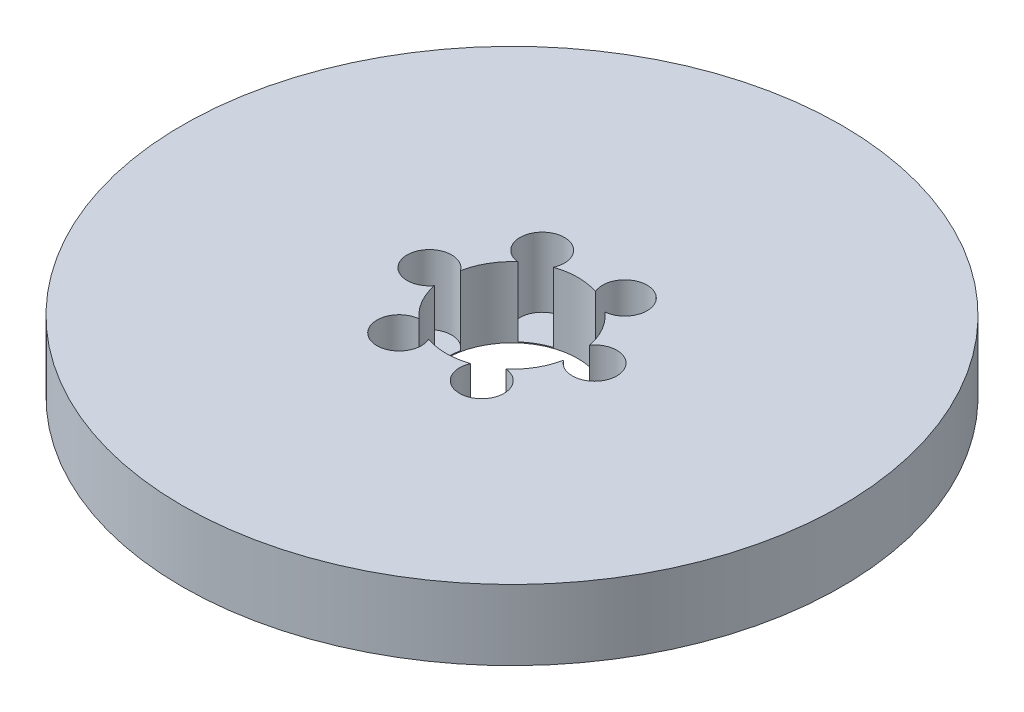
ISO-10303-21;
HEADER;
FILE_DESCRIPTION(('STEP AP214'),'2;1');
FILE_NAME('part.step','',(''),(''),'','','');
FILE_SCHEMA(('AUTOMOTIVE_DESIGN { 1 0 10303 214 1 1 1 1 }'));
ENDSEC;
DATA;
#1=APPLICATION_CONTEXT('core data for automotive mechanical design processes');
#2=APPLICATION_PROTOCOL_DEFINITION('international standard','automotive_design',2000,#1);
#3=PRODUCT_CONTEXT('',#1,'mechanical');
#4=PRODUCT('Part','Part','',(#3));
#5=PRODUCT_RELATED_PRODUCT_CATEGORY('part','',(#4));
#6=PRODUCT_DEFINITION_FORMATION('','',#4);
#7=PRODUCT_DEFINITION_CONTEXT('part definition',#1,'design');
#8=PRODUCT_DEFINITION('design','',#6,#7);
#9=PRODUCT_DEFINITION_SHAPE('','',#8);
#10=(LENGTH_UNIT() NAMED_UNIT(*) SI_UNIT(.MILLI.,.METRE.));
#11=(NAMED_UNIT(*) PLANE_ANGLE_UNIT() SI_UNIT($,.RADIAN.));
#12=(NAMED_UNIT(*) SI_UNIT($,.STERADIAN.) SOLID_ANGLE_UNIT());
#13=UNCERTAINTY_MEASURE_WITH_UNIT(LENGTH_MEASURE(1.E-05),#10,'distance_accuracy_value','');
#14=(GEOMETRIC_REPRESENTATION_CONTEXT(3) GLOBAL_UNCERTAINTY_ASSIGNED_CONTEXT((#13)) GLOBAL_UNIT_ASSIGNED_CONTEXT((#10,
#11,#12)) REPRESENTATION_CONTEXT('',''));
#15=CARTESIAN_POINT('',(0.,0.,0.));
#16=DIRECTION('',(0.,0.,1.));
#17=DIRECTION('',(1.,0.,0.));
#18=AXIS2_PLACEMENT_3D('',#15,#16,#17);
#19=CARTESIAN_POINT('',(0.,8.,0.));
#20=DIRECTION('',(0.,-1.,0.));
#21=DIRECTION('',(0.,0.,-1.));
#22=AXIS2_PLACEMENT_3D('',#19,#20,#21);
#23=CYLINDRICAL_SURFACE('',#22,37.5);
#24=CARTESIAN_POINT('',(0.,8.,0.));
#25=DIRECTION('',(0.,1.,0.));
#26=DIRECTION('',(0.,0.,1.));
#27=AXIS2_PLACEMENT_3D('',#24,#25,#26);
#28=CIRCLE('',#27,37.5);
#29=CARTESIAN_POINT('',(0.,8.,37.5));
#30=VERTEX_POINT('',#29);
#31=EDGE_CURVE('E171',#30,#30,#28,.T.);
#32=ORIENTED_EDGE('',*,*,#31,.F.);
#33=EDGE_LOOP('',(#32));
#34=FACE_BOUND('',#33,.T.);
#35=CARTESIAN_POINT('',(0.,0.,0.));
#36=DIRECTION('',(0.,1.,0.));
#37=DIRECTION('',(0.,0.,1.));
#38=AXIS2_PLACEMENT_3D('',#35,#36,#37);
#39=CIRCLE('',#38,37.5);
#40=CARTESIAN_POINT('',(0.,0.,37.5));
#41=VERTEX_POINT('',#40);
#42=EDGE_CURVE('E157',#41,#41,#39,.T.);
#43=ORIENTED_EDGE('',*,*,#42,.T.);
#44=EDGE_LOOP('',(#43));
#45=FACE_BOUND('',#44,.T.);
#46=ADVANCED_FACE('F39',(#34,#45),#23,.T.);
#47=CARTESIAN_POINT('',(0.,8.,0.));
#48=DIRECTION('',(0.,1.,0.));
#49=DIRECTION('',(0.,0.,1.));
#50=AXIS2_PLACEMENT_3D('',#47,#48,#49);
#51=PLANE('',#50);
#52=CARTESIAN_POINT('',(-4.6996662001571,8.,-8.14006063728605));
#53=DIRECTION('',(0.,1.,0.));
#54=DIRECTION('',(-0.866025403784433,0.,0.50000000000001));
#55=AXIS2_PLACEMENT_3D('',#52,#53,#54);
#56=CIRCLE('',#55,2.53231917771672);
#57=CARTESIAN_POINT('',(-2.38618431158145,8.,-7.11028300640436));
#58=VERTEX_POINT('',#57);
#59=CARTESIAN_POINT('',(-4.96459355585237,8.,-5.62163773514348));
#60=VERTEX_POINT('',#59);
#61=EDGE_CURVE('E214',#58,#60,#56,.T.);
#62=ORIENTED_EDGE('',*,*,#61,.F.);
#63=CARTESIAN_POINT('',(0.,8.,0.));
#64=DIRECTION('',(0.,1.,0.));
#65=DIRECTION('',(0.,0.,1.));
#66=AXIS2_PLACEMENT_3D('',#63,#64,#65);
#67=CIRCLE('',#66,7.5);
#68=CARTESIAN_POINT('',(2.3861843115813,8.,-7.1102830064044));
#69=VERTEX_POINT('',#68);
#70=EDGE_CURVE('E272',#69,#58,#67,.T.);
#71=ORIENTED_EDGE('',*,*,#70,.F.);
#72=CARTESIAN_POINT('',(4.69966620015693,8.,-8.14006063728615));
#73=DIRECTION('',(0.,1.,0.));
#74=DIRECTION('',(-0.866025403784443,0.,-0.499999999999992));
#75=AXIS2_PLACEMENT_3D('',#72,#73,#74);
#76=CIRCLE('',#75,2.53231917771672);
#77=CARTESIAN_POINT('',(4.96459355585225,8.,-5.62163773514358));
#78=VERTEX_POINT('',#77);
#79=EDGE_CURVE('E285',#78,#69,#76,.T.);
#80=ORIENTED_EDGE('',*,*,#79,.F.);
#81=CARTESIAN_POINT('',(7.35077786743367,8.,-1.48864527126085));
#82=VERTEX_POINT('',#81);
#83=EDGE_CURVE('E165',#82,#78,#67,.T.);
#84=ORIENTED_EDGE('',*,*,#83,.F.);
#85=CARTESIAN_POINT('',(9.39933240031402,8.,0.));
#86=DIRECTION('',(0.,1.,0.));
#87=DIRECTION('',(0.,0.,-1.));
#88=AXIS2_PLACEMENT_3D('',#85,#86,#87);
#89=CIRCLE('',#88,2.53231917771672);
#90=CARTESIAN_POINT('',(7.35077786743367,8.,1.48864527126085));
#91=VERTEX_POINT('',#90);
#92=EDGE_CURVE('E281',#91,#82,#89,.T.);
#93=ORIENTED_EDGE('',*,*,#92,.F.);
#94=CARTESIAN_POINT('',(4.96459355585233,8.,5.62163773514352));
#95=VERTEX_POINT('',#94);
#96=EDGE_CURVE('E160',#95,#91,#67,.T.);
#97=ORIENTED_EDGE('',*,*,#96,.F.);
#98=CARTESIAN_POINT('',(4.69966620015705,8.,8.14006063728609));
#99=DIRECTION('',(0.,1.,0.));
#100=DIRECTION('',(0.866025403784436,0.,-0.500000000000004));
#101=AXIS2_PLACEMENT_3D('',#98,#99,#100);
#102=CIRCLE('',#101,2.53231917771672);
#103=CARTESIAN_POINT('',(2.3861843115814,8.,7.11028300640437));
#104=VERTEX_POINT('',#103);
#105=EDGE_CURVE('E154',#104,#95,#102,.T.);
#106=ORIENTED_EDGE('',*,*,#105,.F.);
#107=CARTESIAN_POINT('',(-2.38618431158135,8.,7.11028300640439));
#108=VERTEX_POINT('',#107);
#109=EDGE_CURVE('E150',#108,#104,#67,.T.);
#110=ORIENTED_EDGE('',*,*,#109,.F.);
#111=CARTESIAN_POINT('',(-4.69966620015699,8.,8.14006063728612));
#112=DIRECTION('',(0.,1.,0.));
#113=DIRECTION('',(0.86602540378444,0.,0.499999999999998));
#114=AXIS2_PLACEMENT_3D('',#111,#112,#113);
#115=CIRCLE('',#114,2.53231917771672);
#116=CARTESIAN_POINT('',(-4.96459355585229,8.,5.62163773514355));
#117=VERTEX_POINT('',#116);
#118=EDGE_CURVE('E127',#117,#108,#115,.T.);
#119=ORIENTED_EDGE('',*,*,#118,.F.);
#120=CARTESIAN_POINT('',(-7.35077786743367,8.,1.48864527126085));
#121=VERTEX_POINT('',#120);
#122=EDGE_CURVE('E156',#121,#117,#67,.T.);
#123=ORIENTED_EDGE('',*,*,#122,.F.);
#124=CARTESIAN_POINT('',(-9.39933240031402,8.,0.));
#125=DIRECTION('',(0.,1.,0.));
#126=DIRECTION('',(0.,0.,1.));
#127=AXIS2_PLACEMENT_3D('',#124,#125,#126);
#128=CIRCLE('',#127,2.53231917771672);
#129=CARTESIAN_POINT('',(-7.35077786743367,8.,-1.48864527126085));
#130=VERTEX_POINT('',#129);
#131=EDGE_CURVE('E164',#130,#121,#128,.T.);
#132=ORIENTED_EDGE('',*,*,#131,.F.);
#133=EDGE_CURVE('E159',#60,#130,#67,.T.);
#134=ORIENTED_EDGE('',*,*,#133,.F.);
#135=EDGE_LOOP('',(#62,#71,#80,#84,#93,#97,#106,#110,#119,#123,#132,#134));
#136=FACE_BOUND('',#135,.T.);
#137=ORIENTED_EDGE('',*,*,#31,.T.);
#138=EDGE_LOOP('',(#137));
#139=FACE_BOUND('',#138,.T.);
#140=ADVANCED_FACE('F155',(#136,#139),#51,.T.);
#141=CARTESIAN_POINT('',(0.,0.,0.));
#142=DIRECTION('',(0.,1.,0.));
#143=DIRECTION('',(0.,0.,1.));
#144=AXIS2_PLACEMENT_3D('',#141,#142,#143);
#145=PLANE('',#144);
#146=CARTESIAN_POINT('',(0.,0.,0.));
#147=DIRECTION('',(0.,1.,0.));
#148=DIRECTION('',(0.,0.,1.));
#149=AXIS2_PLACEMENT_3D('',#146,#147,#148);
#150=CIRCLE('',#149,7.5);
#151=CARTESIAN_POINT('',(0.,0.,7.5));
#152=VERTEX_POINT('',#151);
#153=EDGE_CURVE('E170',#152,#152,#150,.T.);
#154=ORIENTED_EDGE('',*,*,#153,.T.);
#155=EDGE_LOOP('',(#154));
#156=FACE_BOUND('',#155,.T.);
#157=ORIENTED_EDGE('',*,*,#42,.F.);
#158=EDGE_LOOP('',(#157));
#159=FACE_BOUND('',#158,.T.);
#160=ADVANCED_FACE('F232',(#156,#159),#145,.F.);
#161=CARTESIAN_POINT('',(0.,8.,0.));
#162=DIRECTION('',(0.,-1.,0.));
#163=DIRECTION('',(0.,0.,-1.));
#164=AXIS2_PLACEMENT_3D('',#161,#162,#163);
#165=CYLINDRICAL_SURFACE('',#164,7.5);
#166=DIRECTION('',(0.,1.,0.));
#167=VECTOR('',#166,1.);
#168=CARTESIAN_POINT('',(-2.38618431158145,4.05151097836171,-7.11028300640436));
#169=LINE('',#168,#167);
#170=CARTESIAN_POINT('',(-2.38618431158145,0.103021956723428,-7.11028300640436));
#171=VERTEX_POINT('',#170);
#172=EDGE_CURVE('E11',#171,#58,#169,.T.);
#173=ORIENTED_EDGE('',*,*,#172,.F.);
#174=CARTESIAN_POINT('',(0.,0.103021956723428,0.));
#175=DIRECTION('',(0.,1.,0.));
#176=DIRECTION('',(0.,0.,1.));
#177=AXIS2_PLACEMENT_3D('',#174,#175,#176);
#178=CIRCLE('',#177,7.5);
#179=CARTESIAN_POINT('',(-4.96459355585237,0.103021956723428,-5.62163773514348));
#180=VERTEX_POINT('',#179);
#181=EDGE_CURVE('E209',#171,#180,#178,.T.);
#182=ORIENTED_EDGE('',*,*,#181,.T.);
#183=DIRECTION('',(0.,1.,0.));
#184=VECTOR('',#183,1.);
#185=CARTESIAN_POINT('',(-4.96459355585237,4.05151097836171,-5.62163773514348));
#186=LINE('',#185,#184);
#187=EDGE_CURVE('E46',#60,#180,#186,.F.);
#188=ORIENTED_EDGE('',*,*,#187,.F.);
#189=ORIENTED_EDGE('',*,*,#133,.T.);
#190=DIRECTION('',(0.,1.,0.));
#191=VECTOR('',#190,1.);
#192=CARTESIAN_POINT('',(-7.35077786743367,4.05151097836171,-1.48864527126085));
#193=LINE('',#192,#191);
#194=CARTESIAN_POINT('',(-7.35077786743367,0.103021956723428,-1.48864527126085));
#195=VERTEX_POINT('',#194);
#196=EDGE_CURVE('E185',#195,#130,#193,.T.);
#197=ORIENTED_EDGE('',*,*,#196,.F.);
#198=CARTESIAN_POINT('',(0.,0.103021956723428,0.));
#199=DIRECTION('',(0.,1.,0.));
#200=DIRECTION('',(0.,0.,1.));
#201=AXIS2_PLACEMENT_3D('',#198,#199,#200);
#202=CIRCLE('',#201,7.5);
#203=CARTESIAN_POINT('',(-7.35077786743367,0.103021956723428,1.48864527126085));
#204=VERTEX_POINT('',#203);
#205=EDGE_CURVE('E173',#195,#204,#202,.T.);
#206=ORIENTED_EDGE('',*,*,#205,.T.);
#207=DIRECTION('',(0.,1.,0.));
#208=VECTOR('',#207,1.);
#209=CARTESIAN_POINT('',(-7.35077786743367,4.05151097836171,1.48864527126085));
#210=LINE('',#209,#208);
#211=EDGE_CURVE('E178',#121,#204,#210,.F.);
#212=ORIENTED_EDGE('',*,*,#211,.F.);
#213=ORIENTED_EDGE('',*,*,#122,.T.);
#214=DIRECTION('',(0.,1.,0.));
#215=VECTOR('',#214,1.);
#216=CARTESIAN_POINT('',(-4.96459355585229,4.05151097836171,5.62163773514355));
#217=LINE('',#216,#215);
#218=CARTESIAN_POINT('',(-4.96459355585229,0.103021956723428,5.62163773514355));
#219=VERTEX_POINT('',#218);
#220=EDGE_CURVE('E132',#219,#117,#217,.T.);
#221=ORIENTED_EDGE('',*,*,#220,.F.);
#222=CARTESIAN_POINT('',(0.,0.103021956723428,0.));
#223=DIRECTION('',(0.,1.,0.));
#224=DIRECTION('',(0.,0.,1.));
#225=AXIS2_PLACEMENT_3D('',#222,#223,#224);
#226=CIRCLE('',#225,7.5);
#227=CARTESIAN_POINT('',(-2.38618431158135,0.103021956723428,7.11028300640439));
#228=VERTEX_POINT('',#227);
#229=EDGE_CURVE('E146',#219,#228,#226,.T.);
#230=ORIENTED_EDGE('',*,*,#229,.T.);
#231=DIRECTION('',(0.,1.,0.));
#232=VECTOR('',#231,1.);
#233=CARTESIAN_POINT('',(-2.38618431158135,4.05151097836171,7.11028300640439));
#234=LINE('',#233,#232);
#235=EDGE_CURVE('E128',#108,#228,#234,.F.);
#236=ORIENTED_EDGE('',*,*,#235,.F.);
#237=ORIENTED_EDGE('',*,*,#109,.T.);
#238=DIRECTION('',(0.,1.,0.));
#239=VECTOR('',#238,1.);
#240=CARTESIAN_POINT('',(2.3861843115814,4.05151097836171,7.11028300640437));
#241=LINE('',#240,#239);
#242=CARTESIAN_POINT('',(2.3861843115814,0.103021956723428,7.11028300640437));
#243=VERTEX_POINT('',#242);
#244=EDGE_CURVE('E192',#243,#104,#241,.T.);
#245=ORIENTED_EDGE('',*,*,#244,.F.);
#246=CARTESIAN_POINT('',(0.,0.103021956723428,0.));
#247=DIRECTION('',(0.,1.,0.));
#248=DIRECTION('',(0.,0.,1.));
#249=AXIS2_PLACEMENT_3D('',#246,#247,#248);
#250=CIRCLE('',#249,7.5);
#251=CARTESIAN_POINT('',(4.96459355585233,0.103021956723428,5.62163773514352));
#252=VERTEX_POINT('',#251);
#253=EDGE_CURVE('E190',#243,#252,#250,.T.);
#254=ORIENTED_EDGE('',*,*,#253,.T.);
#255=DIRECTION('',(0.,1.,0.));
#256=VECTOR('',#255,1.);
#257=CARTESIAN_POINT('',(4.96459355585233,4.05151097836171,5.62163773514352));
#258=LINE('',#257,#256);
#259=EDGE_CURVE('E189',#95,#252,#258,.F.);
#260=ORIENTED_EDGE('',*,*,#259,.F.);
#261=ORIENTED_EDGE('',*,*,#96,.T.);
#262=DIRECTION('',(0.,1.,0.));
#263=VECTOR('',#262,1.);
#264=CARTESIAN_POINT('',(7.35077786743367,4.05151097836171,1.48864527126085));
#265=LINE('',#264,#263);
#266=CARTESIAN_POINT('',(7.35077786743367,0.103021956723428,1.48864527126085));
#267=VERTEX_POINT('',#266);
#268=EDGE_CURVE('E203',#267,#91,#265,.T.);
#269=ORIENTED_EDGE('',*,*,#268,.F.);
#270=CARTESIAN_POINT('',(0.,0.103021956723428,0.));
#271=DIRECTION('',(0.,1.,0.));
#272=DIRECTION('',(0.,0.,1.));
#273=AXIS2_PLACEMENT_3D('',#270,#271,#272);
#274=CIRCLE('',#273,7.5);
#275=CARTESIAN_POINT('',(7.35077786743367,0.103021956723428,-1.48864527126085));
#276=VERTEX_POINT('',#275);
#277=EDGE_CURVE('E194',#267,#276,#274,.T.);
#278=ORIENTED_EDGE('',*,*,#277,.T.);
#279=DIRECTION('',(0.,1.,0.));
#280=VECTOR('',#279,1.);
#281=CARTESIAN_POINT('',(7.35077786743367,4.05151097836171,-1.48864527126085));
#282=LINE('',#281,#280);
#283=EDGE_CURVE('E196',#82,#276,#282,.F.);
#284=ORIENTED_EDGE('',*,*,#283,.F.);
#285=ORIENTED_EDGE('',*,*,#83,.T.);
#286=DIRECTION('',(0.,1.,0.));
#287=VECTOR('',#286,1.);
#288=CARTESIAN_POINT('',(4.96459355585226,4.05151097836171,-5.62163773514358));
#289=LINE('',#288,#287);
#290=CARTESIAN_POINT('',(4.96459355585225,0.103021956723428,-5.62163773514358));
#291=VERTEX_POINT('',#290);
#292=EDGE_CURVE('E208',#291,#78,#289,.T.);
#293=ORIENTED_EDGE('',*,*,#292,.F.);
#294=CARTESIAN_POINT('',(0.,0.103021956723428,0.));
#295=DIRECTION('',(0.,1.,0.));
#296=DIRECTION('',(0.,0.,1.));
#297=AXIS2_PLACEMENT_3D('',#294,#295,#296);
#298=CIRCLE('',#297,7.5);
#299=CARTESIAN_POINT('',(2.3861843115813,0.103021956723428,-7.1102830064044));
#300=VERTEX_POINT('',#299);
#301=EDGE_CURVE('E201',#291,#300,#298,.T.);
#302=ORIENTED_EDGE('',*,*,#301,.T.);
#303=DIRECTION('',(0.,1.,0.));
#304=VECTOR('',#303,1.);
#305=CARTESIAN_POINT('',(2.3861843115813,4.05151097836171,-7.11028300640441));
#306=LINE('',#305,#304);
#307=EDGE_CURVE('E206',#69,#300,#306,.F.);
#308=ORIENTED_EDGE('',*,*,#307,.F.);
#309=ORIENTED_EDGE('',*,*,#70,.T.);
#310=EDGE_LOOP('',(#173,#182,#188,#189,#197,#206,#212,#213,#221,#230,#236,#237,#245,#254,#260,
#261,#269,#278,#284,#285,#293,#302,#308,#309));
#311=FACE_BOUND('',#310,.T.);
#312=ORIENTED_EDGE('',*,*,#153,.F.);
#313=EDGE_LOOP('',(#312));
#314=FACE_BOUND('',#313,.T.);
#315=ADVANCED_FACE('F145',(#311,#314),#165,.F.);
#316=CARTESIAN_POINT('',(-9.39933240031402,0.103021956723428,0.));
#317=DIRECTION('',(0.,1.,0.));
#318=DIRECTION('',(0.,0.,1.));
#319=AXIS2_PLACEMENT_3D('',#316,#317,#318);
#320=CYLINDRICAL_SURFACE('',#319,2.53231917771672);
#321=ORIENTED_EDGE('',*,*,#196,.T.);
#322=ORIENTED_EDGE('',*,*,#131,.T.);
#323=ORIENTED_EDGE('',*,*,#211,.T.);
#324=CARTESIAN_POINT('',(-9.39933240031402,0.103021956723428,0.));
#325=DIRECTION('',(0.,1.,0.));
#326=DIRECTION('',(0.,0.,1.));
#327=AXIS2_PLACEMENT_3D('',#324,#325,#326);
#328=CIRCLE('',#327,2.53231917771672);
#329=EDGE_CURVE('E168',#195,#204,#328,.T.);
#330=ORIENTED_EDGE('',*,*,#329,.F.);
#331=EDGE_LOOP('',(#321,#322,#323,#330));
#332=FACE_BOUND('',#331,.T.);
#333=ADVANCED_FACE('F243',(#332),#320,.F.);
#334=CARTESIAN_POINT('',(-9.39933240031402,0.103021956723428,0.));
#335=DIRECTION('',(0.,1.,0.));
#336=DIRECTION('',(0.,0.,1.));
#337=AXIS2_PLACEMENT_3D('',#334,#335,#336);
#338=PLANE('',#337);
#339=ORIENTED_EDGE('',*,*,#329,.T.);
#340=ORIENTED_EDGE('',*,*,#205,.F.);
#341=EDGE_LOOP('',(#339,#340));
#342=FACE_BOUND('',#341,.T.);
#343=ADVANCED_FACE('F247',(#342),#338,.T.);
#344=CARTESIAN_POINT('',(-4.69966620015699,0.103021956723428,8.14006063728612));
#345=DIRECTION('',(0.,1.,0.));
#346=DIRECTION('',(0.,0.,1.));
#347=AXIS2_PLACEMENT_3D('',#344,#345,#346);
#348=CYLINDRICAL_SURFACE('',#347,2.53231917771672);
#349=ORIENTED_EDGE('',*,*,#220,.T.);
#350=ORIENTED_EDGE('',*,*,#118,.T.);
#351=ORIENTED_EDGE('',*,*,#235,.T.);
#352=CARTESIAN_POINT('',(-4.69966620015699,0.103021956723428,8.14006063728612));
#353=DIRECTION('',(0.,1.,0.));
#354=DIRECTION('',(0.86602540378444,0.,0.499999999999998));
#355=AXIS2_PLACEMENT_3D('',#352,#353,#354);
#356=CIRCLE('',#355,2.53231917771672);
#357=EDGE_CURVE('E137',#219,#228,#356,.T.);
#358=ORIENTED_EDGE('',*,*,#357,.F.);
#359=EDGE_LOOP('',(#349,#350,#351,#358));
#360=FACE_BOUND('',#359,.T.);
#361=ADVANCED_FACE('F126',(#360),#348,.F.);
#362=CARTESIAN_POINT('',(-4.69966620015699,0.103021956723428,8.14006063728612));
#363=DIRECTION('',(0.,1.,0.));
#364=DIRECTION('',(0.86602540378444,0.,0.499999999999998));
#365=AXIS2_PLACEMENT_3D('',#362,#363,#364);
#366=PLANE('',#365);
#367=ORIENTED_EDGE('',*,*,#357,.T.);
#368=ORIENTED_EDGE('',*,*,#229,.F.);
#369=EDGE_LOOP('',(#367,#368));
#370=FACE_BOUND('',#369,.T.);
#371=ADVANCED_FACE('F254',(#370),#366,.T.);
#372=CARTESIAN_POINT('',(4.69966620015705,0.103021956723428,8.14006063728609));
#373=DIRECTION('',(0.,1.,0.));
#374=DIRECTION('',(0.,0.,1.));
#375=AXIS2_PLACEMENT_3D('',#372,#373,#374);
#376=CYLINDRICAL_SURFACE('',#375,2.53231917771672);
#377=ORIENTED_EDGE('',*,*,#244,.T.);
#378=ORIENTED_EDGE('',*,*,#105,.T.);
#379=ORIENTED_EDGE('',*,*,#259,.T.);
#380=CARTESIAN_POINT('',(4.69966620015705,0.103021956723428,8.14006063728609));
#381=DIRECTION('',(0.,1.,0.));
#382=DIRECTION('',(0.866025403784436,0.,-0.500000000000004));
#383=AXIS2_PLACEMENT_3D('',#380,#381,#382);
#384=CIRCLE('',#383,2.53231917771672);
#385=EDGE_CURVE('E138',#243,#252,#384,.T.);
#386=ORIENTED_EDGE('',*,*,#385,.F.);
#387=EDGE_LOOP('',(#377,#378,#379,#386));
#388=FACE_BOUND('',#387,.T.);
#389=ADVANCED_FACE('F260',(#388),#376,.F.);
#390=CARTESIAN_POINT('',(4.69966620015705,0.103021956723428,8.14006063728609));
#391=DIRECTION('',(0.,1.,0.));
#392=DIRECTION('',(0.866025403784436,0.,-0.500000000000004));
#393=AXIS2_PLACEMENT_3D('',#390,#391,#392);
#394=PLANE('',#393);
#395=ORIENTED_EDGE('',*,*,#385,.T.);
#396=ORIENTED_EDGE('',*,*,#253,.F.);
#397=EDGE_LOOP('',(#395,#396));
#398=FACE_BOUND('',#397,.T.);
#399=ADVANCED_FACE('F265',(#398),#394,.T.);
#400=CARTESIAN_POINT('',(9.39933240031402,0.103021956723428,0.));
#401=DIRECTION('',(0.,1.,0.));
#402=DIRECTION('',(0.,0.,1.));
#403=AXIS2_PLACEMENT_3D('',#400,#401,#402);
#404=CYLINDRICAL_SURFACE('',#403,2.53231917771672);
#405=ORIENTED_EDGE('',*,*,#268,.T.);
#406=ORIENTED_EDGE('',*,*,#92,.T.);
#407=ORIENTED_EDGE('',*,*,#283,.T.);
#408=CARTESIAN_POINT('',(9.39933240031402,0.103021956723428,0.));
#409=DIRECTION('',(0.,1.,0.));
#410=DIRECTION('',(0.,0.,-1.));
#411=AXIS2_PLACEMENT_3D('',#408,#409,#410);
#412=CIRCLE('',#411,2.53231917771672);
#413=EDGE_CURVE('E287',#267,#276,#412,.T.);
#414=ORIENTED_EDGE('',*,*,#413,.F.);
#415=EDGE_LOOP('',(#405,#406,#407,#414));
#416=FACE_BOUND('',#415,.T.);
#417=ADVANCED_FACE('F300',(#416),#404,.F.);
#418=CARTESIAN_POINT('',(9.39933240031402,0.103021956723428,0.));
#419=DIRECTION('',(0.,1.,0.));
#420=DIRECTION('',(0.,0.,-1.));
#421=AXIS2_PLACEMENT_3D('',#418,#419,#420);
#422=PLANE('',#421);
#423=ORIENTED_EDGE('',*,*,#413,.T.);
#424=ORIENTED_EDGE('',*,*,#277,.F.);
#425=EDGE_LOOP('',(#423,#424));
#426=FACE_BOUND('',#425,.T.);
#427=ADVANCED_FACE('F298',(#426),#422,.T.);
#428=CARTESIAN_POINT('',(4.69966620015693,0.103021956723428,-8.14006063728615));
#429=DIRECTION('',(0.,1.,0.));
#430=DIRECTION('',(0.,0.,1.));
#431=AXIS2_PLACEMENT_3D('',#428,#429,#430);
#432=CYLINDRICAL_SURFACE('',#431,2.53231917771672);
#433=ORIENTED_EDGE('',*,*,#292,.T.);
#434=ORIENTED_EDGE('',*,*,#79,.T.);
#435=ORIENTED_EDGE('',*,*,#307,.T.);
#436=CARTESIAN_POINT('',(4.69966620015693,0.103021956723428,-8.14006063728615));
#437=DIRECTION('',(0.,1.,0.));
#438=DIRECTION('',(-0.866025403784443,0.,-0.499999999999992));
#439=AXIS2_PLACEMENT_3D('',#436,#437,#438);
#440=CIRCLE('',#439,2.53231917771672);
#441=EDGE_CURVE('E56',#291,#300,#440,.T.);
#442=ORIENTED_EDGE('',*,*,#441,.F.);
#443=EDGE_LOOP('',(#433,#434,#435,#442));
#444=FACE_BOUND('',#443,.T.);
#445=ADVANCED_FACE('F301',(#444),#432,.F.);
#446=CARTESIAN_POINT('',(4.69966620015693,0.103021956723428,-8.14006063728615));
#447=DIRECTION('',(0.,1.,0.));
#448=DIRECTION('',(-0.866025403784443,0.,-0.499999999999992));
#449=AXIS2_PLACEMENT_3D('',#446,#447,#448);
#450=PLANE('',#449);
#451=ORIENTED_EDGE('',*,*,#441,.T.);
#452=ORIENTED_EDGE('',*,*,#301,.F.);
#453=EDGE_LOOP('',(#451,#452));
#454=FACE_BOUND('',#453,.T.);
#455=ADVANCED_FACE('F221',(#454),#450,.T.);
#456=CARTESIAN_POINT('',(-4.6996662001571,0.103021956723428,-8.14006063728605));
#457=DIRECTION('',(0.,1.,0.));
#458=DIRECTION('',(0.,0.,1.));
#459=AXIS2_PLACEMENT_3D('',#456,#457,#458);
#460=CYLINDRICAL_SURFACE('',#459,2.53231917771672);
#461=ORIENTED_EDGE('',*,*,#172,.T.);
#462=ORIENTED_EDGE('',*,*,#61,.T.);
#463=ORIENTED_EDGE('',*,*,#187,.T.);
#464=CARTESIAN_POINT('',(-4.6996662001571,0.103021956723428,-8.14006063728605));
#465=DIRECTION('',(0.,1.,0.));
#466=DIRECTION('',(-0.866025403784433,0.,0.50000000000001));
#467=AXIS2_PLACEMENT_3D('',#464,#465,#466);
#468=CIRCLE('',#467,2.53231917771672);
#469=EDGE_CURVE('E55',#171,#180,#468,.T.);
#470=ORIENTED_EDGE('',*,*,#469,.F.);
#471=EDGE_LOOP('',(#461,#462,#463,#470));
#472=FACE_BOUND('',#471,.T.);
#473=ADVANCED_FACE('F212',(#472),#460,.F.);
#474=CARTESIAN_POINT('',(-4.6996662001571,0.103021956723428,-8.14006063728605));
#475=DIRECTION('',(0.,1.,0.));
#476=DIRECTION('',(-0.866025403784433,0.,0.50000000000001));
#477=AXIS2_PLACEMENT_3D('',#474,#475,#476);
#478=PLANE('',#477);
#479=ORIENTED_EDGE('',*,*,#469,.T.);
#480=ORIENTED_EDGE('',*,*,#181,.F.);
#481=EDGE_LOOP('',(#479,#480));
#482=FACE_BOUND('',#481,.T.);
#483=ADVANCED_FACE('F217',(#482),#478,.T.);
#484=CLOSED_SHELL('',(#46,#140,#160,#315,#333,#343,#361,#371,#389,#399,#417,#427,#445,#455,#473,#483));
#485=MANIFOLD_SOLID_BREP('B2',#484);
#486=ADVANCED_BREP_SHAPE_REPRESENTATION('',(#18,#485),#14);
#487=SHAPE_DEFINITION_REPRESENTATION(#9,#486);
ENDSEC;
END-ISO-10303-21;
